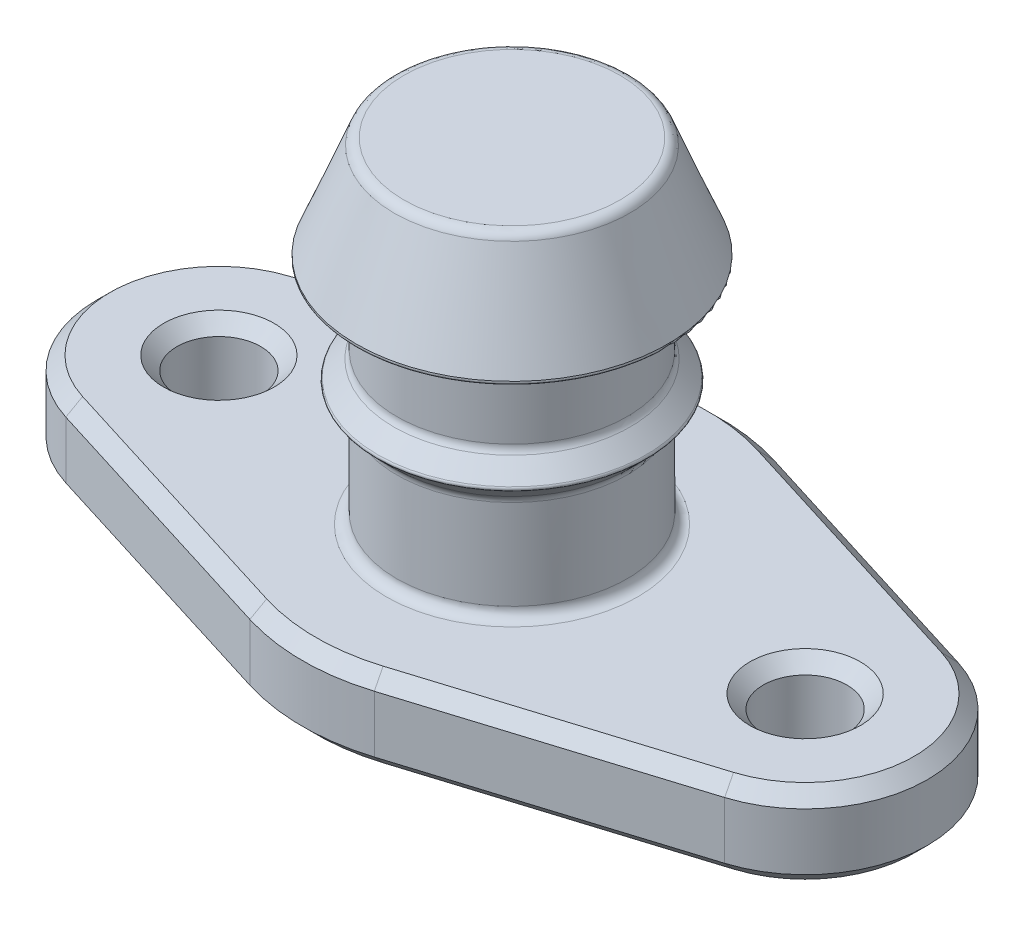
ISO-10303-21;
HEADER;
FILE_DESCRIPTION(('STEP AP214'),'2;1');
FILE_NAME('part.step','',(''),(''),'','','');
FILE_SCHEMA(('AUTOMOTIVE_DESIGN { 1 0 10303 214 1 1 1 1 }'));
ENDSEC;
DATA;
#1=APPLICATION_CONTEXT('core data for automotive mechanical design processes');
#2=APPLICATION_PROTOCOL_DEFINITION('international standard','automotive_design',2000,#1);
#3=PRODUCT_CONTEXT('',#1,'mechanical');
#4=PRODUCT('Part','Part','',(#3));
#5=PRODUCT_RELATED_PRODUCT_CATEGORY('part','',(#4));
#6=PRODUCT_DEFINITION_FORMATION('','',#4);
#7=PRODUCT_DEFINITION_CONTEXT('part definition',#1,'design');
#8=PRODUCT_DEFINITION('design','',#6,#7);
#9=PRODUCT_DEFINITION_SHAPE('','',#8);
#10=(LENGTH_UNIT() NAMED_UNIT(*) SI_UNIT(.MILLI.,.METRE.));
#11=(NAMED_UNIT(*) PLANE_ANGLE_UNIT() SI_UNIT($,.RADIAN.));
#12=(NAMED_UNIT(*) SI_UNIT($,.STERADIAN.) SOLID_ANGLE_UNIT());
#13=UNCERTAINTY_MEASURE_WITH_UNIT(LENGTH_MEASURE(1.E-05),#10,'distance_accuracy_value','');
#14=(GEOMETRIC_REPRESENTATION_CONTEXT(3) GLOBAL_UNCERTAINTY_ASSIGNED_CONTEXT((#13)) GLOBAL_UNIT_ASSIGNED_CONTEXT((#10,
#11,#12)) REPRESENTATION_CONTEXT('',''));
#15=CARTESIAN_POINT('',(0.,0.,0.));
#16=DIRECTION('',(0.,0.,1.));
#17=DIRECTION('',(1.,0.,0.));
#18=AXIS2_PLACEMENT_3D('',#15,#16,#17);
#19=CARTESIAN_POINT('',(0.,0.,0.));
#20=DIRECTION('',(0.,-1.,0.));
#21=DIRECTION('',(0.,0.,-1.));
#22=AXIS2_PLACEMENT_3D('',#19,#20,#21);
#23=CYLINDRICAL_SURFACE('',#22,7.9375);
#24=DIRECTION('',(0.,-1.,0.));
#25=VECTOR('',#24,1.);
#26=CARTESIAN_POINT('',(2.35857142857143,23.3997616978469,-7.57898720584265));
#27=LINE('',#26,#25);
#28=CARTESIAN_POINT('',(2.35857142857143,2.66700000000002,-7.57898720584265));
#29=VERTEX_POINT('',#28);
#30=CARTESIAN_POINT('',(2.35857142857143,0.508000000000012,-7.57898720584265));
#31=VERTEX_POINT('',#30);
#32=EDGE_CURVE('E328',#29,#31,#27,.T.);
#33=ORIENTED_EDGE('',*,*,#32,.T.);
#34=CARTESIAN_POINT('',(0.,0.508000000000005,0.));
#35=DIRECTION('',(0.,-1.,0.));
#36=DIRECTION('',(0.,0.,-1.));
#37=AXIS2_PLACEMENT_3D('',#34,#35,#36);
#38=CIRCLE('',#37,7.9375);
#39=CARTESIAN_POINT('',(-2.35857142857143,0.508000000000012,-7.57898720584265));
#40=VERTEX_POINT('',#39);
#41=EDGE_CURVE('E207',#31,#40,#38,.F.);
#42=ORIENTED_EDGE('',*,*,#41,.T.);
#43=DIRECTION('',(0.,-1.,0.));
#44=VECTOR('',#43,1.);
#45=CARTESIAN_POINT('',(-2.35857142857143,23.3997616978469,-7.57898720584265));
#46=LINE('',#45,#44);
#47=CARTESIAN_POINT('',(-2.35857142857143,2.66700000000002,-7.57898720584265));
#48=VERTEX_POINT('',#47);
#49=EDGE_CURVE('E317',#48,#40,#46,.T.);
#50=ORIENTED_EDGE('',*,*,#49,.F.);
#51=CARTESIAN_POINT('',(0.,2.66700000000001,0.));
#52=DIRECTION('',(0.,1.,0.));
#53=DIRECTION('',(0.,0.,1.));
#54=AXIS2_PLACEMENT_3D('',#51,#52,#53);
#55=CIRCLE('',#54,7.9375);
#56=EDGE_CURVE('E205',#48,#29,#55,.F.);
#57=ORIENTED_EDGE('',*,*,#56,.T.);
#58=EDGE_LOOP('',(#33,#42,#50,#57));
#59=FACE_BOUND('',#58,.T.);
#60=ADVANCED_FACE('F35',(#59),#23,.T.);
#61=DIRECTION('',(0.,-1.,0.));
#62=VECTOR('',#61,1.);
#63=CARTESIAN_POINT('',(-2.35857142857143,23.3997616978469,7.57898720584265));
#64=LINE('',#63,#62);
#65=CARTESIAN_POINT('',(-2.35857142857143,2.66700000000002,7.57898720584265));
#66=VERTEX_POINT('',#65);
#67=CARTESIAN_POINT('',(-2.35857142857143,0.508000000000012,7.57898720584265));
#68=VERTEX_POINT('',#67);
#69=EDGE_CURVE('E259',#66,#68,#64,.T.);
#70=ORIENTED_EDGE('',*,*,#69,.T.);
#71=CARTESIAN_POINT('',(0.,0.508000000000005,0.));
#72=DIRECTION('',(0.,-1.,0.));
#73=DIRECTION('',(0.,0.,-1.));
#74=AXIS2_PLACEMENT_3D('',#71,#72,#73);
#75=CIRCLE('',#74,7.9375);
#76=CARTESIAN_POINT('',(2.35857142857143,0.508000000000012,7.57898720584265));
#77=VERTEX_POINT('',#76);
#78=EDGE_CURVE('E224',#68,#77,#75,.F.);
#79=ORIENTED_EDGE('',*,*,#78,.T.);
#80=DIRECTION('',(0.,-1.,0.));
#81=VECTOR('',#80,1.);
#82=CARTESIAN_POINT('',(2.35857142857143,23.3997616978469,7.57898720584265));
#83=LINE('',#82,#81);
#84=CARTESIAN_POINT('',(2.35857142857143,2.66700000000002,7.57898720584265));
#85=VERTEX_POINT('',#84);
#86=EDGE_CURVE('E311',#85,#77,#83,.T.);
#87=ORIENTED_EDGE('',*,*,#86,.F.);
#88=CARTESIAN_POINT('',(0.,2.66700000000001,0.));
#89=DIRECTION('',(0.,1.,0.));
#90=DIRECTION('',(0.,0.,1.));
#91=AXIS2_PLACEMENT_3D('',#88,#89,#90);
#92=CIRCLE('',#91,7.9375);
#93=EDGE_CURVE('E222',#85,#66,#92,.F.);
#94=ORIENTED_EDGE('',*,*,#93,.T.);
#95=EDGE_LOOP('',(#70,#79,#87,#94));
#96=FACE_BOUND('',#95,.T.);
#97=ADVANCED_FACE('F309',(#96),#23,.T.);
#98=CARTESIAN_POINT('',(0.,0.,0.));
#99=DIRECTION('',(0.,-1.,0.));
#100=DIRECTION('',(0.,0.,-1.));
#101=AXIS2_PLACEMENT_3D('',#98,#99,#100);
#102=PLANE('',#101);
#103=CARTESIAN_POINT('',(-11.1125,0.,0.));
#104=DIRECTION('',(0.,-1.,0.));
#105=DIRECTION('',(0.,0.,-1.));
#106=AXIS2_PLACEMENT_3D('',#103,#104,#105);
#107=CIRCLE('',#106,2.09550000000002);
#108=CARTESIAN_POINT('',(-11.1125,0.,-2.09550000000002));
#109=VERTEX_POINT('',#108);
#110=EDGE_CURVE('E180',#109,#109,#107,.F.);
#111=ORIENTED_EDGE('',*,*,#110,.T.);
#112=EDGE_LOOP('',(#111));
#113=FACE_BOUND('',#112,.T.);
#114=CARTESIAN_POINT('',(11.1125,0.,0.));
#115=DIRECTION('',(0.,-1.,0.));
#116=DIRECTION('',(0.,0.,-1.));
#117=AXIS2_PLACEMENT_3D('',#114,#115,#116);
#118=CIRCLE('',#117,2.09550000000002);
#119=CARTESIAN_POINT('',(11.1125,0.,-2.09550000000002));
#120=VERTEX_POINT('',#119);
#121=EDGE_CURVE('E177',#120,#120,#118,.F.);
#122=ORIENTED_EDGE('',*,*,#121,.T.);
#123=EDGE_LOOP('',(#122));
#124=FACE_BOUND('',#123,.T.);
#125=CARTESIAN_POINT('',(11.1125,0.,0.));
#126=DIRECTION('',(0.,-1.,0.));
#127=DIRECTION('',(0.,0.,-1.));
#128=AXIS2_PLACEMENT_3D('',#125,#126,#127);
#129=CIRCLE('',#128,4.1275);
#130=CARTESIAN_POINT('',(12.3389571428571,0.,-3.94107334703817));
#131=VERTEX_POINT('',#130);
#132=CARTESIAN_POINT('',(12.3389571428571,0.,3.94107334703817));
#133=VERTEX_POINT('',#132);
#134=EDGE_CURVE('E175',#131,#133,#129,.T.);
#135=ORIENTED_EDGE('',*,*,#134,.T.);
#136=DIRECTION('',(-0.954833033806948,0.,0.297142857142857));
#137=VECTOR('',#136,1.);
#138=CARTESIAN_POINT('',(2.20762285714286,0.,7.09393202466871));
#139=LINE('',#138,#137);
#140=CARTESIAN_POINT('',(2.20762285714286,0.,7.09393202466871));
#141=VERTEX_POINT('',#140);
#142=EDGE_CURVE('E156',#133,#141,#139,.T.);
#143=ORIENTED_EDGE('',*,*,#142,.T.);
#144=CARTESIAN_POINT('',(0.,0.,0.));
#145=DIRECTION('',(0.,-1.,0.));
#146=DIRECTION('',(0.,0.,-1.));
#147=AXIS2_PLACEMENT_3D('',#144,#145,#146);
#148=CIRCLE('',#147,7.4295);
#149=CARTESIAN_POINT('',(-2.20762285714285,0.,7.09393202466871));
#150=VERTEX_POINT('',#149);
#151=EDGE_CURVE('E164',#141,#150,#148,.T.);
#152=ORIENTED_EDGE('',*,*,#151,.T.);
#153=DIRECTION('',(-0.954833033806948,0.,-0.297142857142857));
#154=VECTOR('',#153,1.);
#155=CARTESIAN_POINT('',(-2.20762285714285,0.,7.09393202466871));
#156=LINE('',#155,#154);
#157=CARTESIAN_POINT('',(-12.3389571428571,0.,3.94107334703817));
#158=VERTEX_POINT('',#157);
#159=EDGE_CURVE('E170',#150,#158,#156,.T.);
#160=ORIENTED_EDGE('',*,*,#159,.T.);
#161=CARTESIAN_POINT('',(-11.1125,0.,0.));
#162=DIRECTION('',(0.,-1.,0.));
#163=DIRECTION('',(0.,0.,-1.));
#164=AXIS2_PLACEMENT_3D('',#161,#162,#163);
#165=CIRCLE('',#164,4.1275);
#166=CARTESIAN_POINT('',(-12.3389571428571,0.,-3.94107334703817));
#167=VERTEX_POINT('',#166);
#168=EDGE_CURVE('E384',#158,#167,#165,.T.);
#169=ORIENTED_EDGE('',*,*,#168,.T.);
#170=DIRECTION('',(0.954833033806948,0.,-0.297142857142857));
#171=VECTOR('',#170,1.);
#172=CARTESIAN_POINT('',(-2.20762285714286,0.,-7.09393202466871));
#173=LINE('',#172,#171);
#174=CARTESIAN_POINT('',(-2.20762285714286,0.,-7.09393202466871));
#175=VERTEX_POINT('',#174);
#176=EDGE_CURVE('E386',#167,#175,#173,.T.);
#177=ORIENTED_EDGE('',*,*,#176,.T.);
#178=CARTESIAN_POINT('',(0.,0.,0.));
#179=DIRECTION('',(0.,-1.,0.));
#180=DIRECTION('',(0.,0.,-1.));
#181=AXIS2_PLACEMENT_3D('',#178,#179,#180);
#182=CIRCLE('',#181,7.42949999999999);
#183=CARTESIAN_POINT('',(2.20762285714286,0.,-7.09393202466871));
#184=VERTEX_POINT('',#183);
#185=EDGE_CURVE('E388',#175,#184,#182,.T.);
#186=ORIENTED_EDGE('',*,*,#185,.T.);
#187=DIRECTION('',(0.954833033806948,0.,0.297142857142857));
#188=VECTOR('',#187,1.);
#189=CARTESIAN_POINT('',(2.20762285714286,0.,-7.09393202466871));
#190=LINE('',#189,#188);
#191=EDGE_CURVE('E182',#184,#131,#190,.T.);
#192=ORIENTED_EDGE('',*,*,#191,.T.);
#193=EDGE_LOOP('',(#135,#143,#152,#160,#169,#177,#186,#192));
#194=FACE_BOUND('',#193,.T.);
#195=ADVANCED_FACE('F173',(#113,#124,#194),#102,.T.);
#196=CARTESIAN_POINT('',(7.9375,3.175,0.));
#197=DIRECTION('',(0.,1.,0.));
#198=DIRECTION('',(0.,0.,1.));
#199=AXIS2_PLACEMENT_3D('',#196,#197,#198);
#200=PLANE('',#199);
#201=CARTESIAN_POINT('',(-11.1125,3.175,0.));
#202=DIRECTION('',(0.,1.,0.));
#203=DIRECTION('',(0.,0.,1.));
#204=AXIS2_PLACEMENT_3D('',#201,#202,#203);
#205=CIRCLE('',#204,2.09549999999998);
#206=CARTESIAN_POINT('',(-11.1125,3.175,2.09549999999998));
#207=VERTEX_POINT('',#206);
#208=EDGE_CURVE('E11',#207,#207,#205,.F.);
#209=ORIENTED_EDGE('',*,*,#208,.T.);
#210=EDGE_LOOP('',(#209));
#211=FACE_BOUND('',#210,.T.);
#212=CARTESIAN_POINT('',(11.1125,3.175,0.));
#213=DIRECTION('',(0.,1.,0.));
#214=DIRECTION('',(0.,0.,1.));
#215=AXIS2_PLACEMENT_3D('',#212,#213,#214);
#216=CIRCLE('',#215,2.09549999999997);
#217=CARTESIAN_POINT('',(11.1125,3.175,2.09549999999997));
#218=VERTEX_POINT('',#217);
#219=EDGE_CURVE('E45',#218,#218,#216,.F.);
#220=ORIENTED_EDGE('',*,*,#219,.T.);
#221=EDGE_LOOP('',(#220));
#222=FACE_BOUND('',#221,.T.);
#223=CARTESIAN_POINT('',(-11.1125,3.175,0.));
#224=DIRECTION('',(0.,1.,0.));
#225=DIRECTION('',(0.,0.,1.));
#226=AXIS2_PLACEMENT_3D('',#223,#224,#225);
#227=CIRCLE('',#226,4.1275);
#228=CARTESIAN_POINT('',(-12.3389571428571,3.175,-3.94107334703818));
#229=VERTEX_POINT('',#228);
#230=CARTESIAN_POINT('',(-12.3389571428571,3.175,3.94107334703818));
#231=VERTEX_POINT('',#230);
#232=EDGE_CURVE('E53',#229,#231,#227,.T.);
#233=ORIENTED_EDGE('',*,*,#232,.T.);
#234=DIRECTION('',(0.954833033806948,0.,0.297142857142857));
#235=VECTOR('',#234,1.);
#236=CARTESIAN_POINT('',(5.02904448979592,3.175,9.34597393726196));
#237=LINE('',#236,#235);
#238=CARTESIAN_POINT('',(-2.20762285714286,3.175,7.09393202466872));
#239=VERTEX_POINT('',#238);
#240=EDGE_CURVE('E238',#231,#239,#237,.T.);
#241=ORIENTED_EDGE('',*,*,#240,.T.);
#242=CARTESIAN_POINT('',(0.,3.175,0.));
#243=DIRECTION('',(0.,1.,0.));
#244=DIRECTION('',(0.,0.,1.));
#245=AXIS2_PLACEMENT_3D('',#242,#243,#244);
#246=CIRCLE('',#245,7.42950000000001);
#247=CARTESIAN_POINT('',(2.20762285714286,3.175,7.09393202466872));
#248=VERTEX_POINT('',#247);
#249=EDGE_CURVE('E226',#239,#248,#246,.T.);
#250=ORIENTED_EDGE('',*,*,#249,.T.);
#251=DIRECTION('',(0.954833033806948,0.,-0.297142857142857));
#252=VECTOR('',#251,1.);
#253=CARTESIAN_POINT('',(9.44429020408163,3.175,4.84189011207548));
#254=LINE('',#253,#252);
#255=CARTESIAN_POINT('',(12.3389571428571,3.175,3.94107334703818));
#256=VERTEX_POINT('',#255);
#257=EDGE_CURVE('E228',#248,#256,#254,.T.);
#258=ORIENTED_EDGE('',*,*,#257,.T.);
#259=CARTESIAN_POINT('',(11.1125,3.175,0.));
#260=DIRECTION('',(0.,1.,0.));
#261=DIRECTION('',(0.,0.,1.));
#262=AXIS2_PLACEMENT_3D('',#259,#260,#261);
#263=CIRCLE('',#262,4.1275);
#264=CARTESIAN_POINT('',(12.3389571428571,3.175,-3.94107334703818));
#265=VERTEX_POINT('',#264);
#266=EDGE_CURVE('E230',#256,#265,#263,.T.);
#267=ORIENTED_EDGE('',*,*,#266,.T.);
#268=DIRECTION('',(-0.954833033806948,0.,-0.297142857142857));
#269=VECTOR('',#268,1.);
#270=CARTESIAN_POINT('',(9.44429020408163,3.175,-4.84189011207548));
#271=LINE('',#270,#269);
#272=CARTESIAN_POINT('',(2.20762285714286,3.175,-7.09393202466872));
#273=VERTEX_POINT('',#272);
#274=EDGE_CURVE('E232',#265,#273,#271,.T.);
#275=ORIENTED_EDGE('',*,*,#274,.T.);
#276=CARTESIAN_POINT('',(0.,3.175,0.));
#277=DIRECTION('',(0.,1.,0.));
#278=DIRECTION('',(0.,0.,1.));
#279=AXIS2_PLACEMENT_3D('',#276,#277,#278);
#280=CIRCLE('',#279,7.42950000000001);
#281=CARTESIAN_POINT('',(-2.20762285714286,3.175,-7.09393202466872));
#282=VERTEX_POINT('',#281);
#283=EDGE_CURVE('E234',#273,#282,#280,.T.);
#284=ORIENTED_EDGE('',*,*,#283,.T.);
#285=DIRECTION('',(-0.954833033806948,0.,0.297142857142857));
#286=VECTOR('',#285,1.);
#287=CARTESIAN_POINT('',(5.02904448979592,3.175,-9.34597393726197));
#288=LINE('',#287,#286);
#289=EDGE_CURVE('E58',#282,#229,#288,.T.);
#290=ORIENTED_EDGE('',*,*,#289,.T.);
#291=EDGE_LOOP('',(#233,#241,#250,#258,#267,#275,#284,#290));
#292=FACE_BOUND('',#291,.T.);
#293=CARTESIAN_POINT('',(0.,3.175,0.));
#294=DIRECTION('',(0.,1.,0.));
#295=DIRECTION('',(0.,0.,1.));
#296=AXIS2_PLACEMENT_3D('',#293,#294,#295);
#297=CIRCLE('',#296,4.7625);
#298=CARTESIAN_POINT('',(0.,3.175,4.7625));
#299=VERTEX_POINT('',#298);
#300=EDGE_CURVE('E363',#299,#299,#297,.F.);
#301=ORIENTED_EDGE('',*,*,#300,.T.);
#302=EDGE_LOOP('',(#301));
#303=FACE_BOUND('',#302,.T.);
#304=ADVANCED_FACE('F291',(#211,#222,#292,#303),#200,.T.);
#305=CARTESIAN_POINT('',(0.,0.,0.));
#306=DIRECTION('',(0.,-1.,0.));
#307=DIRECTION('',(0.,0.,-1.));
#308=AXIS2_PLACEMENT_3D('',#305,#306,#307);
#309=CYLINDRICAL_SURFACE('',#308,4.365625);
#310=CARTESIAN_POINT('',(0.,6.97935899243318,0.));
#311=DIRECTION('',(0.,-1.,0.));
#312=DIRECTION('',(0.,0.,-1.));
#313=AXIS2_PLACEMENT_3D('',#310,#311,#312);
#314=CIRCLE('',#313,4.365625);
#315=CARTESIAN_POINT('',(0.,6.97935899243318,-4.365625));
#316=VERTEX_POINT('',#315);
#317=EDGE_CURVE('E354',#316,#316,#314,.T.);
#318=ORIENTED_EDGE('',*,*,#317,.T.);
#319=EDGE_LOOP('',(#318));
#320=FACE_BOUND('',#319,.T.);
#321=CARTESIAN_POINT('',(0.,3.571875,0.));
#322=DIRECTION('',(0.,1.,0.));
#323=DIRECTION('',(0.,0.,1.));
#324=AXIS2_PLACEMENT_3D('',#321,#322,#323);
#325=CIRCLE('',#324,4.365625);
#326=CARTESIAN_POINT('',(0.,3.571875,4.365625));
#327=VERTEX_POINT('',#326);
#328=EDGE_CURVE('E351',#327,#327,#325,.T.);
#329=ORIENTED_EDGE('',*,*,#328,.T.);
#330=EDGE_LOOP('',(#329));
#331=FACE_BOUND('',#330,.T.);
#332=ADVANCED_FACE('F729',(#320,#331),#309,.T.);
#333=CARTESIAN_POINT('',(0.,7.14375,0.));
#334=DIRECTION('',(0.,1.,0.));
#335=DIRECTION('',(0.,0.,1.));
#336=AXIS2_PLACEMENT_3D('',#333,#334,#335);
#337=CONICAL_SURFACE('',#336,4.365625,0.785398163397448);
#338=CARTESIAN_POINT('',(0.,7.86734174905415,0.));
#339=DIRECTION('',(0.,-1.,0.));
#340=DIRECTION('',(0.,0.,-1.));
#341=AXIS2_PLACEMENT_3D('',#338,#339,#340);
#342=CIRCLE('',#341,5.08921674905415);
#343=CARTESIAN_POINT('',(0.,7.86734174905415,-5.08921674905415));
#344=VERTEX_POINT('',#343);
#345=EDGE_CURVE('E366',#344,#344,#342,.T.);
#346=ORIENTED_EDGE('',*,*,#345,.T.);
#347=EDGE_LOOP('',(#346));
#348=FACE_BOUND('',#347,.T.);
#349=CARTESIAN_POINT('',(0.,7.25999199621659,0.));
#350=DIRECTION('',(0.,1.,0.));
#351=DIRECTION('',(0.,0.,1.));
#352=AXIS2_PLACEMENT_3D('',#349,#350,#351);
#353=CIRCLE('',#352,4.48186699621659);
#354=CARTESIAN_POINT('',(0.,7.25999199621659,4.48186699621659));
#355=VERTEX_POINT('',#354);
#356=EDGE_CURVE('E357',#355,#355,#353,.T.);
#357=ORIENTED_EDGE('',*,*,#356,.T.);
#358=EDGE_LOOP('',(#357));
#359=FACE_BOUND('',#358,.T.);
#360=ADVANCED_FACE('F772',(#348,#359),#337,.T.);
#361=CARTESIAN_POINT('',(0.,7.9375,0.));
#362=DIRECTION('',(0.,-1.,0.));
#363=DIRECTION('',(0.,0.,-1.));
#364=AXIS2_PLACEMENT_3D('',#361,#362,#363);
#365=CONICAL_SURFACE('',#364,5.159375,0.785398163397448);
#366=CARTESIAN_POINT('',(0.,8.00765825094585,0.));
#367=DIRECTION('',(0.,1.,0.));
#368=DIRECTION('',(0.,0.,1.));
#369=AXIS2_PLACEMENT_3D('',#366,#367,#368);
#370=CIRCLE('',#369,5.08921674905415);
#371=CARTESIAN_POINT('',(0.,8.00765825094585,5.08921674905415));
#372=VERTEX_POINT('',#371);
#373=EDGE_CURVE('E369',#372,#372,#370,.T.);
#374=ORIENTED_EDGE('',*,*,#373,.T.);
#375=EDGE_LOOP('',(#374));
#376=FACE_BOUND('',#375,.T.);
#377=CARTESIAN_POINT('',(0.,8.61500800378341,0.));
#378=DIRECTION('',(0.,-1.,0.));
#379=DIRECTION('',(0.,0.,-1.));
#380=AXIS2_PLACEMENT_3D('',#377,#378,#379);
#381=CIRCLE('',#380,4.48186699621659);
#382=CARTESIAN_POINT('',(0.,8.61500800378341,-4.48186699621659));
#383=VERTEX_POINT('',#382);
#384=EDGE_CURVE('E360',#383,#383,#381,.T.);
#385=ORIENTED_EDGE('',*,*,#384,.T.);
#386=EDGE_LOOP('',(#385));
#387=FACE_BOUND('',#386,.T.);
#388=ADVANCED_FACE('F780',(#376,#387),#365,.T.);
#389=CARTESIAN_POINT('',(0.,0.,0.));
#390=DIRECTION('',(0.,-1.,0.));
#391=DIRECTION('',(0.,0.,-1.));
#392=AXIS2_PLACEMENT_3D('',#389,#390,#391);
#393=CYLINDRICAL_SURFACE('',#392,4.365625);
#394=CARTESIAN_POINT('',(0.,11.509375,0.));
#395=DIRECTION('',(0.,-1.,0.));
#396=DIRECTION('',(0.,0.,-1.));
#397=AXIS2_PLACEMENT_3D('',#394,#395,#396);
#398=CIRCLE('',#397,4.365625);
#399=CARTESIAN_POINT('',(0.,11.509375,-4.365625));
#400=VERTEX_POINT('',#399);
#401=EDGE_CURVE('E345',#400,#400,#398,.T.);
#402=ORIENTED_EDGE('',*,*,#401,.T.);
#403=EDGE_LOOP('',(#402));
#404=FACE_BOUND('',#403,.T.);
#405=CARTESIAN_POINT('',(0.,8.89564100756682,0.));
#406=DIRECTION('',(0.,-1.,0.));
#407=DIRECTION('',(0.,0.,-1.));
#408=AXIS2_PLACEMENT_3D('',#405,#406,#407);
#409=CIRCLE('',#408,4.365625);
#410=CARTESIAN_POINT('',(0.,8.89564100756682,-4.365625));
#411=VERTEX_POINT('',#410);
#412=EDGE_CURVE('E342',#411,#411,#409,.F.);
#413=ORIENTED_EDGE('',*,*,#412,.T.);
#414=EDGE_LOOP('',(#413));
#415=FACE_BOUND('',#414,.T.);
#416=ADVANCED_FACE('F789',(#404,#415),#393,.T.);
#417=CARTESIAN_POINT('',(4.365625,11.90625,0.));
#418=DIRECTION('',(0.,-1.,0.));
#419=DIRECTION('',(0.,0.,-1.));
#420=AXIS2_PLACEMENT_3D('',#417,#418,#419);
#421=PLANE('',#420);
#422=CARTESIAN_POINT('',(0.,11.90625,0.));
#423=DIRECTION('',(0.,-1.,0.));
#424=DIRECTION('',(0.,0.,-1.));
#425=AXIS2_PLACEMENT_3D('',#422,#423,#424);
#426=CIRCLE('',#425,5.80657563585843);
#427=CARTESIAN_POINT('',(0.,11.90625,-5.80657563585843));
#428=VERTEX_POINT('',#427);
#429=EDGE_CURVE('E372',#428,#428,#426,.T.);
#430=ORIENTED_EDGE('',*,*,#429,.T.);
#431=EDGE_LOOP('',(#430));
#432=FACE_BOUND('',#431,.T.);
#433=CARTESIAN_POINT('',(0.,11.90625,0.));
#434=DIRECTION('',(0.,-1.,0.));
#435=DIRECTION('',(0.,0.,-1.));
#436=AXIS2_PLACEMENT_3D('',#433,#434,#435);
#437=CIRCLE('',#436,4.7625);
#438=CARTESIAN_POINT('',(0.,11.90625,-4.7625));
#439=VERTEX_POINT('',#438);
#440=EDGE_CURVE('E348',#439,#439,#437,.F.);
#441=ORIENTED_EDGE('',*,*,#440,.T.);
#442=EDGE_LOOP('',(#441));
#443=FACE_BOUND('',#442,.T.);
#444=ADVANCED_FACE('F798',(#432,#443),#421,.T.);
#445=CARTESIAN_POINT('',(0.,11.90625,0.));
#446=DIRECTION('',(0.,-1.,0.));
#447=DIRECTION('',(0.,0.,-1.));
#448=AXIS2_PLACEMENT_3D('',#445,#446,#447);
#449=CONICAL_SURFACE('',#448,5.953125,0.380506377112366);
#450=CARTESIAN_POINT('',(0.,12.0423176686695,0.));
#451=DIRECTION('',(0.,1.,0.));
#452=DIRECTION('',(0.,0.,1.));
#453=AXIS2_PLACEMENT_3D('',#450,#451,#452);
#454=CIRCLE('',#453,5.8986979325322);
#455=CARTESIAN_POINT('',(0.,12.0423176686695,5.8986979325322));
#456=VERTEX_POINT('',#455);
#457=EDGE_CURVE('E375',#456,#456,#454,.T.);
#458=ORIENTED_EDGE('',*,*,#457,.T.);
#459=EDGE_LOOP('',(#458));
#460=FACE_BOUND('',#459,.T.);
#461=CARTESIAN_POINT('',(0.,15.625520674678,0.));
#462=DIRECTION('',(0.,1.,0.));
#463=DIRECTION('',(0.,0.,1.));
#464=AXIS2_PLACEMENT_3D('',#461,#462,#463);
#465=CIRCLE('',#464,4.46541673012879);
#466=CARTESIAN_POINT('',(0.,15.625520674678,4.46541673012879));
#467=VERTEX_POINT('',#466);
#468=EDGE_CURVE('E334',#467,#467,#465,.F.);
#469=ORIENTED_EDGE('',*,*,#468,.T.);
#470=EDGE_LOOP('',(#469));
#471=FACE_BOUND('',#470,.T.);
#472=ADVANCED_FACE('F806',(#460,#471),#449,.T.);
#473=CARTESIAN_POINT('',(4.365625,15.875,0.));
#474=DIRECTION('',(0.,1.,0.));
#475=DIRECTION('',(0.,0.,1.));
#476=AXIS2_PLACEMENT_3D('',#473,#474,#475);
#477=PLANE('',#476);
#478=CARTESIAN_POINT('',(0.,15.875,0.));
#479=DIRECTION('',(0.,1.,0.));
#480=DIRECTION('',(0.,0.,1.));
#481=AXIS2_PLACEMENT_3D('',#478,#479,#480);
#482=CIRCLE('',#481,4.0969275434337);
#483=CARTESIAN_POINT('',(0.,15.875,4.0969275434337));
#484=VERTEX_POINT('',#483);
#485=EDGE_CURVE('E339',#484,#484,#482,.T.);
#486=ORIENTED_EDGE('',*,*,#485,.T.);
#487=EDGE_LOOP('',(#486));
#488=FACE_BOUND('',#487,.T.);
#489=ADVANCED_FACE('F720',(#488),#477,.T.);
#490=CARTESIAN_POINT('',(12.4899057142857,23.3997616978469,4.42612852821211));
#491=DIRECTION('',(0.297142857142857,0.,0.954833033806948));
#492=DIRECTION('',(0.954833033806948,0.,-0.297142857142857));
#493=AXIS2_PLACEMENT_3D('',#490,#491,#492);
#494=PLANE('',#493);
#495=ORIENTED_EDGE('',*,*,#86,.T.);
#496=DIRECTION('',(0.954833033806948,0.,-0.297142857142857));
#497=VECTOR('',#496,1.);
#498=CARTESIAN_POINT('',(12.4899057142857,0.508000000000005,4.42612852821211));
#499=LINE('',#498,#497);
#500=CARTESIAN_POINT('',(12.4899057142857,0.508000000000012,4.42612852821211));
#501=VERTEX_POINT('',#500);
#502=EDGE_CURVE('E158',#77,#501,#499,.T.);
#503=ORIENTED_EDGE('',*,*,#502,.T.);
#504=DIRECTION('',(0.,-1.,0.));
#505=VECTOR('',#504,1.);
#506=CARTESIAN_POINT('',(12.4899057142857,23.3997616978469,4.42612852821211));
#507=LINE('',#506,#505);
#508=CARTESIAN_POINT('',(12.4899057142857,2.66700000000002,4.42612852821211));
#509=VERTEX_POINT('',#508);
#510=EDGE_CURVE('E327',#509,#501,#507,.T.);
#511=ORIENTED_EDGE('',*,*,#510,.F.);
#512=DIRECTION('',(-0.954833033806948,0.,0.297142857142857));
#513=VECTOR('',#512,1.);
#514=CARTESIAN_POINT('',(12.4899057142857,2.66700000000001,4.42612852821211));
#515=LINE('',#514,#513);
#516=EDGE_CURVE('E194',#509,#85,#515,.T.);
#517=ORIENTED_EDGE('',*,*,#516,.T.);
#518=EDGE_LOOP('',(#495,#503,#511,#517));
#519=FACE_BOUND('',#518,.T.);
#520=ADVANCED_FACE('F403',(#519),#494,.T.);
#521=CARTESIAN_POINT('',(11.1125,23.3997616978469,0.));
#522=DIRECTION('',(0.,-1.,0.));
#523=DIRECTION('',(0.,0.,-1.));
#524=AXIS2_PLACEMENT_3D('',#521,#522,#523);
#525=CYLINDRICAL_SURFACE('',#524,4.6355);
#526=ORIENTED_EDGE('',*,*,#510,.T.);
#527=CARTESIAN_POINT('',(11.1125,0.508000000000005,0.));
#528=DIRECTION('',(0.,-1.,0.));
#529=DIRECTION('',(0.,0.,-1.));
#530=AXIS2_PLACEMENT_3D('',#527,#528,#529);
#531=CIRCLE('',#530,4.6355);
#532=CARTESIAN_POINT('',(12.4899057142857,0.508000000000012,-4.42612852821211));
#533=VERTEX_POINT('',#532);
#534=EDGE_CURVE('E199',#501,#533,#531,.F.);
#535=ORIENTED_EDGE('',*,*,#534,.T.);
#536=DIRECTION('',(0.,-1.,0.));
#537=VECTOR('',#536,1.);
#538=CARTESIAN_POINT('',(12.4899057142857,23.3997616978469,-4.42612852821211));
#539=LINE('',#538,#537);
#540=CARTESIAN_POINT('',(12.4899057142857,2.66700000000001,-4.42612852821211));
#541=VERTEX_POINT('',#540);
#542=EDGE_CURVE('E331',#541,#533,#539,.T.);
#543=ORIENTED_EDGE('',*,*,#542,.F.);
#544=CARTESIAN_POINT('',(11.1125,2.66700000000001,0.));
#545=DIRECTION('',(0.,1.,0.));
#546=DIRECTION('',(0.,0.,1.));
#547=AXIS2_PLACEMENT_3D('',#544,#545,#546);
#548=CIRCLE('',#547,4.6355);
#549=EDGE_CURVE('E197',#541,#509,#548,.F.);
#550=ORIENTED_EDGE('',*,*,#549,.T.);
#551=EDGE_LOOP('',(#526,#535,#543,#550));
#552=FACE_BOUND('',#551,.T.);
#553=ADVANCED_FACE('F404',(#552),#525,.T.);
#554=CARTESIAN_POINT('',(2.35857142857143,23.3997616978469,-7.57898720584265));
#555=DIRECTION('',(0.297142857142857,0.,-0.954833033806948));
#556=DIRECTION('',(-0.954833033806948,0.,-0.297142857142857));
#557=AXIS2_PLACEMENT_3D('',#554,#555,#556);
#558=PLANE('',#557);
#559=ORIENTED_EDGE('',*,*,#542,.T.);
#560=DIRECTION('',(-0.954833033806948,0.,-0.297142857142857));
#561=VECTOR('',#560,1.);
#562=CARTESIAN_POINT('',(2.35857142857143,0.508000000000005,-7.57898720584265));
#563=LINE('',#562,#561);
#564=EDGE_CURVE('E203',#533,#31,#563,.T.);
#565=ORIENTED_EDGE('',*,*,#564,.T.);
#566=ORIENTED_EDGE('',*,*,#32,.F.);
#567=DIRECTION('',(0.954833033806948,0.,0.297142857142857));
#568=VECTOR('',#567,1.);
#569=CARTESIAN_POINT('',(2.35857142857143,2.66700000000001,-7.57898720584265));
#570=LINE('',#569,#568);
#571=EDGE_CURVE('E201',#29,#541,#570,.T.);
#572=ORIENTED_EDGE('',*,*,#571,.T.);
#573=EDGE_LOOP('',(#559,#565,#566,#572));
#574=FACE_BOUND('',#573,.T.);
#575=ADVANCED_FACE('F406',(#574),#558,.T.);
#576=CARTESIAN_POINT('',(11.1125,23.3997616978469,0.));
#577=DIRECTION('',(0.,-1.,0.));
#578=DIRECTION('',(0.,0.,-1.));
#579=AXIS2_PLACEMENT_3D('',#576,#577,#578);
#580=CYLINDRICAL_SURFACE('',#579,1.5875);
#581=CARTESIAN_POINT('',(11.1125,0.508000000000019,0.));
#582=DIRECTION('',(0.,-1.,0.));
#583=DIRECTION('',(0.,0.,-1.));
#584=AXIS2_PLACEMENT_3D('',#581,#582,#583);
#585=CIRCLE('',#584,1.5875);
#586=CARTESIAN_POINT('',(11.1125,0.508000000000019,-1.5875));
#587=VERTEX_POINT('',#586);
#588=EDGE_CURVE('E191',#587,#587,#585,.T.);
#589=ORIENTED_EDGE('',*,*,#588,.T.);
#590=EDGE_LOOP('',(#589));
#591=FACE_BOUND('',#590,.T.);
#592=CARTESIAN_POINT('',(11.1125,2.66700000000003,0.));
#593=DIRECTION('',(0.,1.,0.));
#594=DIRECTION('',(0.,0.,1.));
#595=AXIS2_PLACEMENT_3D('',#592,#593,#594);
#596=CIRCLE('',#595,1.5875);
#597=CARTESIAN_POINT('',(11.1125,2.66700000000003,1.5875));
#598=VERTEX_POINT('',#597);
#599=EDGE_CURVE('E188',#598,#598,#596,.T.);
#600=ORIENTED_EDGE('',*,*,#599,.T.);
#601=EDGE_LOOP('',(#600));
#602=FACE_BOUND('',#601,.T.);
#603=ADVANCED_FACE('F686',(#591,#602),#580,.F.);
#604=CARTESIAN_POINT('',(-12.4899057142857,23.3997616978469,-4.42612852821211));
#605=DIRECTION('',(-0.297142857142857,0.,-0.954833033806948));
#606=DIRECTION('',(-0.954833033806948,0.,0.297142857142857));
#607=AXIS2_PLACEMENT_3D('',#604,#605,#606);
#608=PLANE('',#607);
#609=ORIENTED_EDGE('',*,*,#49,.T.);
#610=DIRECTION('',(-0.954833033806948,0.,0.297142857142857));
#611=VECTOR('',#610,1.);
#612=CARTESIAN_POINT('',(-12.4899057142857,0.508000000000005,-4.42612852821211));
#613=LINE('',#612,#611);
#614=CARTESIAN_POINT('',(-12.4899057142857,0.508000000000012,-4.42612852821211));
#615=VERTEX_POINT('',#614);
#616=EDGE_CURVE('E211',#40,#615,#613,.T.);
#617=ORIENTED_EDGE('',*,*,#616,.T.);
#618=DIRECTION('',(0.,-1.,0.));
#619=VECTOR('',#618,1.);
#620=CARTESIAN_POINT('',(-12.4899057142857,23.3997616978469,-4.42612852821211));
#621=LINE('',#620,#619);
#622=CARTESIAN_POINT('',(-12.4899057142857,2.66700000000002,-4.42612852821211));
#623=VERTEX_POINT('',#622);
#624=EDGE_CURVE('E320',#623,#615,#621,.T.);
#625=ORIENTED_EDGE('',*,*,#624,.F.);
#626=DIRECTION('',(0.954833033806948,0.,-0.297142857142857));
#627=VECTOR('',#626,1.);
#628=CARTESIAN_POINT('',(-12.4899057142857,2.66700000000001,-4.42612852821211));
#629=LINE('',#628,#627);
#630=EDGE_CURVE('E209',#623,#48,#629,.T.);
#631=ORIENTED_EDGE('',*,*,#630,.T.);
#632=EDGE_LOOP('',(#609,#617,#625,#631));
#633=FACE_BOUND('',#632,.T.);
#634=ADVANCED_FACE('F423',(#633),#608,.T.);
#635=CARTESIAN_POINT('',(-11.1125,23.3997616978469,0.));
#636=DIRECTION('',(0.,-1.,0.));
#637=DIRECTION('',(0.,0.,-1.));
#638=AXIS2_PLACEMENT_3D('',#635,#636,#637);
#639=CYLINDRICAL_SURFACE('',#638,4.6355);
#640=ORIENTED_EDGE('',*,*,#624,.T.);
#641=CARTESIAN_POINT('',(-11.1125,0.508000000000005,0.));
#642=DIRECTION('',(0.,-1.,0.));
#643=DIRECTION('',(0.,0.,-1.));
#644=AXIS2_PLACEMENT_3D('',#641,#642,#643);
#645=CIRCLE('',#644,4.6355);
#646=CARTESIAN_POINT('',(-12.4899057142857,0.508000000000012,4.42612852821211));
#647=VERTEX_POINT('',#646);
#648=EDGE_CURVE('E215',#615,#647,#645,.F.);
#649=ORIENTED_EDGE('',*,*,#648,.T.);
#650=DIRECTION('',(0.,-1.,0.));
#651=VECTOR('',#650,1.);
#652=CARTESIAN_POINT('',(-12.4899057142857,23.3997616978469,4.42612852821211));
#653=LINE('',#652,#651);
#654=CARTESIAN_POINT('',(-12.4899057142857,2.66700000000001,4.42612852821211));
#655=VERTEX_POINT('',#654);
#656=EDGE_CURVE('E324',#655,#647,#653,.T.);
#657=ORIENTED_EDGE('',*,*,#656,.F.);
#658=CARTESIAN_POINT('',(-11.1125,2.66700000000001,0.));
#659=DIRECTION('',(0.,1.,0.));
#660=DIRECTION('',(0.,0.,1.));
#661=AXIS2_PLACEMENT_3D('',#658,#659,#660);
#662=CIRCLE('',#661,4.6355);
#663=EDGE_CURVE('E213',#655,#623,#662,.F.);
#664=ORIENTED_EDGE('',*,*,#663,.T.);
#665=EDGE_LOOP('',(#640,#649,#657,#664));
#666=FACE_BOUND('',#665,.T.);
#667=ADVANCED_FACE('F426',(#666),#639,.T.);
#668=CARTESIAN_POINT('',(-12.4899057142857,23.3997616978469,4.42612852821211));
#669=DIRECTION('',(-0.297142857142857,0.,0.954833033806948));
#670=DIRECTION('',(0.954833033806948,0.,0.297142857142857));
#671=AXIS2_PLACEMENT_3D('',#668,#669,#670);
#672=PLANE('',#671);
#673=ORIENTED_EDGE('',*,*,#656,.T.);
#674=DIRECTION('',(0.954833033806948,0.,0.297142857142857));
#675=VECTOR('',#674,1.);
#676=CARTESIAN_POINT('',(-12.4899057142857,0.508000000000005,4.42612852821211));
#677=LINE('',#676,#675);
#678=EDGE_CURVE('E220',#647,#68,#677,.T.);
#679=ORIENTED_EDGE('',*,*,#678,.T.);
#680=ORIENTED_EDGE('',*,*,#69,.F.);
#681=DIRECTION('',(-0.954833033806948,0.,-0.297142857142857));
#682=VECTOR('',#681,1.);
#683=CARTESIAN_POINT('',(-12.4899057142857,2.66700000000001,4.42612852821211));
#684=LINE('',#683,#682);
#685=EDGE_CURVE('E217',#66,#655,#684,.T.);
#686=ORIENTED_EDGE('',*,*,#685,.T.);
#687=EDGE_LOOP('',(#673,#679,#680,#686));
#688=FACE_BOUND('',#687,.T.);
#689=ADVANCED_FACE('F314',(#688),#672,.T.);
#690=CARTESIAN_POINT('',(-11.1125,23.3997616978469,0.));
#691=DIRECTION('',(0.,-1.,0.));
#692=DIRECTION('',(0.,0.,-1.));
#693=AXIS2_PLACEMENT_3D('',#690,#691,#692);
#694=CYLINDRICAL_SURFACE('',#693,1.5875);
#695=CARTESIAN_POINT('',(-11.1125,0.508000000000019,0.));
#696=DIRECTION('',(0.,-1.,0.));
#697=DIRECTION('',(0.,0.,-1.));
#698=AXIS2_PLACEMENT_3D('',#695,#696,#697);
#699=CIRCLE('',#698,1.5875);
#700=CARTESIAN_POINT('',(-11.1125,0.508000000000019,-1.5875));
#701=VERTEX_POINT('',#700);
#702=EDGE_CURVE('E171',#701,#701,#699,.T.);
#703=ORIENTED_EDGE('',*,*,#702,.T.);
#704=EDGE_LOOP('',(#703));
#705=FACE_BOUND('',#704,.T.);
#706=CARTESIAN_POINT('',(-11.1125,2.66700000000002,0.));
#707=DIRECTION('',(0.,1.,0.));
#708=DIRECTION('',(0.,0.,1.));
#709=AXIS2_PLACEMENT_3D('',#706,#707,#708);
#710=CIRCLE('',#709,1.5875);
#711=CARTESIAN_POINT('',(-11.1125,2.66700000000002,1.5875));
#712=VERTEX_POINT('',#711);
#713=EDGE_CURVE('E378',#712,#712,#710,.T.);
#714=ORIENTED_EDGE('',*,*,#713,.T.);
#715=EDGE_LOOP('',(#714));
#716=FACE_BOUND('',#715,.T.);
#717=ADVANCED_FACE('F459',(#705,#716),#694,.F.);
#718=CARTESIAN_POINT('',(0.,15.478125,0.));
#719=DIRECTION('',(0.,1.,0.));
#720=DIRECTION('',(0.,0.,1.));
#721=AXIS2_PLACEMENT_3D('',#718,#719,#720);
#722=TOROIDAL_SURFACE('',#721,4.0969275434337,0.396875);
#723=ORIENTED_EDGE('',*,*,#485,.F.);
#724=EDGE_LOOP('',(#723));
#725=FACE_BOUND('',#724,.T.);
#726=ORIENTED_EDGE('',*,*,#468,.F.);
#727=EDGE_LOOP('',(#726));
#728=FACE_BOUND('',#727,.T.);
#729=ADVANCED_FACE('F455',(#725,#728),#722,.T.);
#730=CARTESIAN_POINT('',(0.,11.509375,0.));
#731=DIRECTION('',(0.,-1.,0.));
#732=DIRECTION('',(0.,0.,-1.));
#733=AXIS2_PLACEMENT_3D('',#730,#731,#732);
#734=TOROIDAL_SURFACE('',#733,4.7625,0.396875);
#735=ORIENTED_EDGE('',*,*,#440,.F.);
#736=EDGE_LOOP('',(#735));
#737=FACE_BOUND('',#736,.T.);
#738=ORIENTED_EDGE('',*,*,#401,.F.);
#739=EDGE_LOOP('',(#738));
#740=FACE_BOUND('',#739,.T.);
#741=ADVANCED_FACE('F458',(#737,#740),#734,.F.);
#742=CARTESIAN_POINT('',(0.,6.97935899243318,0.));
#743=DIRECTION('',(0.,-1.,0.));
#744=DIRECTION('',(0.,0.,-1.));
#745=AXIS2_PLACEMENT_3D('',#742,#743,#744);
#746=TOROIDAL_SURFACE('',#745,4.7625,0.396875);
#747=ORIENTED_EDGE('',*,*,#356,.F.);
#748=EDGE_LOOP('',(#747));
#749=FACE_BOUND('',#748,.T.);
#750=ORIENTED_EDGE('',*,*,#317,.F.);
#751=EDGE_LOOP('',(#750));
#752=FACE_BOUND('',#751,.T.);
#753=ADVANCED_FACE('F463',(#749,#752),#746,.F.);
#754=CARTESIAN_POINT('',(0.,8.89564100756682,0.));
#755=DIRECTION('',(0.,-1.,0.));
#756=DIRECTION('',(0.,0.,-1.));
#757=AXIS2_PLACEMENT_3D('',#754,#755,#756);
#758=TOROIDAL_SURFACE('',#757,4.7625,0.396875);
#759=ORIENTED_EDGE('',*,*,#412,.F.);
#760=EDGE_LOOP('',(#759));
#761=FACE_BOUND('',#760,.T.);
#762=ORIENTED_EDGE('',*,*,#384,.F.);
#763=EDGE_LOOP('',(#762));
#764=FACE_BOUND('',#763,.T.);
#765=ADVANCED_FACE('F467',(#761,#764),#758,.F.);
#766=CARTESIAN_POINT('',(0.,3.571875,0.));
#767=DIRECTION('',(0.,1.,0.));
#768=DIRECTION('',(0.,0.,1.));
#769=AXIS2_PLACEMENT_3D('',#766,#767,#768);
#770=TOROIDAL_SURFACE('',#769,4.7625,0.396875);
#771=ORIENTED_EDGE('',*,*,#328,.F.);
#772=EDGE_LOOP('',(#771));
#773=FACE_BOUND('',#772,.T.);
#774=ORIENTED_EDGE('',*,*,#300,.F.);
#775=EDGE_LOOP('',(#774));
#776=FACE_BOUND('',#775,.T.);
#777=ADVANCED_FACE('F471',(#773,#776),#770,.F.);
#778=CARTESIAN_POINT('',(0.,7.9375,0.));
#779=DIRECTION('',(0.,1.,0.));
#780=DIRECTION('',(0.,0.,1.));
#781=AXIS2_PLACEMENT_3D('',#778,#779,#780);
#782=TOROIDAL_SURFACE('',#781,5.0190584981083,0.09921875);
#783=ORIENTED_EDGE('',*,*,#373,.F.);
#784=EDGE_LOOP('',(#783));
#785=FACE_BOUND('',#784,.T.);
#786=ORIENTED_EDGE('',*,*,#345,.F.);
#787=EDGE_LOOP('',(#786));
#788=FACE_BOUND('',#787,.T.);
#789=ADVANCED_FACE('F475',(#785,#788),#782,.T.);
#790=CARTESIAN_POINT('',(0.,12.00546875,0.));
#791=DIRECTION('',(0.,-1.,0.));
#792=DIRECTION('',(0.,0.,-1.));
#793=AXIS2_PLACEMENT_3D('',#790,#791,#792);
#794=TOROIDAL_SURFACE('',#793,5.80657563585843,0.09921875);
#795=ORIENTED_EDGE('',*,*,#457,.F.);
#796=EDGE_LOOP('',(#795));
#797=FACE_BOUND('',#796,.T.);
#798=ORIENTED_EDGE('',*,*,#429,.F.);
#799=EDGE_LOOP('',(#798));
#800=FACE_BOUND('',#799,.T.);
#801=ADVANCED_FACE('F479',(#797,#800),#794,.T.);
#802=CARTESIAN_POINT('',(-11.1125,0.508000000000019,0.));
#803=DIRECTION('',(0.,-1.,0.));
#804=DIRECTION('',(0.,0.,-1.));
#805=AXIS2_PLACEMENT_3D('',#802,#803,#804);
#806=CONICAL_SURFACE('',#805,1.5875,0.78539816339745);
#807=ORIENTED_EDGE('',*,*,#110,.F.);
#808=EDGE_LOOP('',(#807));
#809=FACE_BOUND('',#808,.T.);
#810=ORIENTED_EDGE('',*,*,#702,.F.);
#811=EDGE_LOOP('',(#810));
#812=FACE_BOUND('',#811,.T.);
#813=ADVANCED_FACE('F483',(#809,#812),#806,.F.);
#814=CARTESIAN_POINT('',(11.1125,0.508000000000019,0.));
#815=DIRECTION('',(0.,-1.,0.));
#816=DIRECTION('',(0.,0.,-1.));
#817=AXIS2_PLACEMENT_3D('',#814,#815,#816);
#818=CONICAL_SURFACE('',#817,1.5875,0.78539816339745);
#819=ORIENTED_EDGE('',*,*,#121,.F.);
#820=EDGE_LOOP('',(#819));
#821=FACE_BOUND('',#820,.T.);
#822=ORIENTED_EDGE('',*,*,#588,.F.);
#823=EDGE_LOOP('',(#822));
#824=FACE_BOUND('',#823,.T.);
#825=ADVANCED_FACE('F491',(#821,#824),#818,.F.);
#826=CARTESIAN_POINT('',(-2.20762285714286,0.,-7.09393202466871));
#827=DIRECTION('',(0.21011172926686,0.707106781186548,0.675168913105816));
#828=DIRECTION('',(0.954833033806948,0.,-0.297142857142857));
#829=AXIS2_PLACEMENT_3D('',#826,#827,#828);
#830=PLANE('',#829);
#831=DIRECTION('',(0.210111729266859,-0.707106781186547,0.675168913105817));
#832=VECTOR('',#831,1.);
#833=CARTESIAN_POINT('',(-12.4899057142857,0.508000000000005,-4.42612852821211));
#834=LINE('',#833,#832);
#835=EDGE_CURVE('E253',#615,#167,#834,.T.);
#836=ORIENTED_EDGE('',*,*,#835,.F.);
#837=ORIENTED_EDGE('',*,*,#616,.F.);
#838=DIRECTION('',(-0.21011172926686,0.707106781186547,-0.675168913105817));
#839=VECTOR('',#838,1.);
#840=CARTESIAN_POINT('',(-2.20762285714286,0.,-7.09393202466871));
#841=LINE('',#840,#839);
#842=EDGE_CURVE('E256',#175,#40,#841,.T.);
#843=ORIENTED_EDGE('',*,*,#842,.F.);
#844=ORIENTED_EDGE('',*,*,#176,.F.);
#845=EDGE_LOOP('',(#836,#837,#843,#844));
#846=FACE_BOUND('',#845,.T.);
#847=ADVANCED_FACE('F418',(#846),#830,.F.);
#848=CARTESIAN_POINT('',(0.,0.,0.));
#849=DIRECTION('',(0.,1.,0.));
#850=DIRECTION('',(0.,0.,1.));
#851=AXIS2_PLACEMENT_3D('',#848,#849,#850);
#852=CONICAL_SURFACE('',#851,7.4295,0.785398163397448);
#853=ORIENTED_EDGE('',*,*,#842,.T.);
#854=ORIENTED_EDGE('',*,*,#41,.F.);
#855=DIRECTION('',(0.21011172926686,0.707106781186547,-0.675168913105817));
#856=VECTOR('',#855,1.);
#857=CARTESIAN_POINT('',(2.20762285714286,0.,-7.09393202466871));
#858=LINE('',#857,#856);
#859=EDGE_CURVE('E250',#184,#31,#858,.T.);
#860=ORIENTED_EDGE('',*,*,#859,.F.);
#861=ORIENTED_EDGE('',*,*,#185,.F.);
#862=EDGE_LOOP('',(#853,#854,#860,#861));
#863=FACE_BOUND('',#862,.T.);
#864=ADVANCED_FACE('F412',(#863),#852,.T.);
#865=CARTESIAN_POINT('',(-11.1125,0.,0.));
#866=DIRECTION('',(0.,1.,0.));
#867=DIRECTION('',(0.,0.,1.));
#868=AXIS2_PLACEMENT_3D('',#865,#866,#867);
#869=CONICAL_SURFACE('',#868,4.1275,0.785398163397448);
#870=ORIENTED_EDGE('',*,*,#835,.T.);
#871=ORIENTED_EDGE('',*,*,#168,.F.);
#872=DIRECTION('',(0.210111729266859,-0.707106781186547,-0.675168913105817));
#873=VECTOR('',#872,1.);
#874=CARTESIAN_POINT('',(-12.4899057142857,0.508000000000005,4.4261285282121));
#875=LINE('',#874,#873);
#876=EDGE_CURVE('E247',#647,#158,#875,.T.);
#877=ORIENTED_EDGE('',*,*,#876,.F.);
#878=ORIENTED_EDGE('',*,*,#648,.F.);
#879=EDGE_LOOP('',(#870,#871,#877,#878));
#880=FACE_BOUND('',#879,.T.);
#881=ADVANCED_FACE('F431',(#880),#869,.T.);
#882=CARTESIAN_POINT('',(2.20762285714286,0.,-7.09393202466871));
#883=DIRECTION('',(-0.21011172926686,0.707106781186548,0.675168913105817));
#884=DIRECTION('',(0.954833033806948,0.,0.297142857142857));
#885=AXIS2_PLACEMENT_3D('',#882,#883,#884);
#886=PLANE('',#885);
#887=ORIENTED_EDGE('',*,*,#859,.T.);
#888=ORIENTED_EDGE('',*,*,#564,.F.);
#889=DIRECTION('',(0.210111729266859,0.707106781186548,-0.675168913105817));
#890=VECTOR('',#889,1.);
#891=CARTESIAN_POINT('',(12.3389571428571,0.,-3.94107334703817));
#892=LINE('',#891,#890);
#893=EDGE_CURVE('E244',#131,#533,#892,.T.);
#894=ORIENTED_EDGE('',*,*,#893,.F.);
#895=ORIENTED_EDGE('',*,*,#191,.F.);
#896=EDGE_LOOP('',(#887,#888,#894,#895));
#897=FACE_BOUND('',#896,.T.);
#898=ADVANCED_FACE('F395',(#897),#886,.F.);
#899=CARTESIAN_POINT('',(-2.20762285714285,0.,7.09393202466871));
#900=DIRECTION('',(0.21011172926686,0.707106781186547,-0.675168913105817));
#901=DIRECTION('',(-0.954833033806948,0.,-0.297142857142857));
#902=AXIS2_PLACEMENT_3D('',#899,#900,#901);
#903=PLANE('',#902);
#904=ORIENTED_EDGE('',*,*,#876,.T.);
#905=ORIENTED_EDGE('',*,*,#159,.F.);
#906=DIRECTION('',(0.21011172926686,-0.707106781186548,-0.675168913105816));
#907=VECTOR('',#906,1.);
#908=CARTESIAN_POINT('',(-2.35857142857143,0.508000000000005,7.57898720584265));
#909=LINE('',#908,#907);
#910=EDGE_CURVE('E167',#68,#150,#909,.T.);
#911=ORIENTED_EDGE('',*,*,#910,.F.);
#912=ORIENTED_EDGE('',*,*,#678,.F.);
#913=EDGE_LOOP('',(#904,#905,#911,#912));
#914=FACE_BOUND('',#913,.T.);
#915=ADVANCED_FACE('F433',(#914),#903,.F.);
#916=CARTESIAN_POINT('',(11.1125,0.,0.));
#917=DIRECTION('',(0.,1.,0.));
#918=DIRECTION('',(0.,0.,1.));
#919=AXIS2_PLACEMENT_3D('',#916,#917,#918);
#920=CONICAL_SURFACE('',#919,4.1275,0.785398163397448);
#921=ORIENTED_EDGE('',*,*,#893,.T.);
#922=ORIENTED_EDGE('',*,*,#534,.F.);
#923=DIRECTION('',(0.210111729266859,0.707106781186548,0.675168913105817));
#924=VECTOR('',#923,1.);
#925=CARTESIAN_POINT('',(12.3389571428571,0.,3.94107334703817));
#926=LINE('',#925,#924);
#927=EDGE_CURVE('E161',#133,#501,#926,.T.);
#928=ORIENTED_EDGE('',*,*,#927,.F.);
#929=ORIENTED_EDGE('',*,*,#134,.F.);
#930=EDGE_LOOP('',(#921,#922,#928,#929));
#931=FACE_BOUND('',#930,.T.);
#932=ADVANCED_FACE('F398',(#931),#920,.T.);
#933=CARTESIAN_POINT('',(0.,0.,0.));
#934=DIRECTION('',(0.,1.,0.));
#935=DIRECTION('',(0.,0.,1.));
#936=AXIS2_PLACEMENT_3D('',#933,#934,#935);
#937=CONICAL_SURFACE('',#936,7.4295,0.785398163397448);
#938=ORIENTED_EDGE('',*,*,#910,.T.);
#939=ORIENTED_EDGE('',*,*,#151,.F.);
#940=DIRECTION('',(-0.21011172926686,-0.707106781186547,-0.675168913105817));
#941=VECTOR('',#940,1.);
#942=CARTESIAN_POINT('',(2.35857142857143,0.508000000000005,7.57898720584265));
#943=LINE('',#942,#941);
#944=EDGE_CURVE('E152',#77,#141,#943,.T.);
#945=ORIENTED_EDGE('',*,*,#944,.F.);
#946=ORIENTED_EDGE('',*,*,#78,.F.);
#947=EDGE_LOOP('',(#938,#939,#945,#946));
#948=FACE_BOUND('',#947,.T.);
#949=ADVANCED_FACE('F165',(#948),#937,.T.);
#950=CARTESIAN_POINT('',(2.20762285714286,0.,7.09393202466871));
#951=DIRECTION('',(-0.21011172926686,0.707106781186548,-0.675168913105817));
#952=DIRECTION('',(-0.954833033806948,0.,0.297142857142857));
#953=AXIS2_PLACEMENT_3D('',#950,#951,#952);
#954=PLANE('',#953);
#955=ORIENTED_EDGE('',*,*,#927,.T.);
#956=ORIENTED_EDGE('',*,*,#502,.F.);
#957=ORIENTED_EDGE('',*,*,#944,.T.);
#958=ORIENTED_EDGE('',*,*,#142,.F.);
#959=EDGE_LOOP('',(#955,#956,#957,#958));
#960=FACE_BOUND('',#959,.T.);
#961=ADVANCED_FACE('F154',(#960),#954,.F.);
#962=CARTESIAN_POINT('',(-11.1125,3.175,0.));
#963=DIRECTION('',(0.,1.,0.));
#964=DIRECTION('',(0.,0.,1.));
#965=AXIS2_PLACEMENT_3D('',#962,#963,#964);
#966=CONICAL_SURFACE('',#965,2.09549999999998,0.785398163397453);
#967=ORIENTED_EDGE('',*,*,#713,.F.);
#968=EDGE_LOOP('',(#967));
#969=FACE_BOUND('',#968,.T.);
#970=ORIENTED_EDGE('',*,*,#208,.F.);
#971=EDGE_LOOP('',(#970));
#972=FACE_BOUND('',#971,.T.);
#973=ADVANCED_FACE('F506',(#969,#972),#966,.F.);
#974=CARTESIAN_POINT('',(11.1125,3.175,0.));
#975=DIRECTION('',(0.,1.,0.));
#976=DIRECTION('',(0.,0.,1.));
#977=AXIS2_PLACEMENT_3D('',#974,#975,#976);
#978=CONICAL_SURFACE('',#977,2.09549999999997,0.78539816339745);
#979=ORIENTED_EDGE('',*,*,#599,.F.);
#980=EDGE_LOOP('',(#979));
#981=FACE_BOUND('',#980,.T.);
#982=ORIENTED_EDGE('',*,*,#219,.F.);
#983=EDGE_LOOP('',(#982));
#984=FACE_BOUND('',#983,.T.);
#985=ADVANCED_FACE('F536',(#981,#984),#978,.F.);
#986=CARTESIAN_POINT('',(2.35857142857143,2.66700000000001,-7.57898720584265));
#987=DIRECTION('',(-0.210111729266859,-0.707106781186551,0.675168913105813));
#988=DIRECTION('',(0.954833033806948,0.,0.297142857142857));
#989=AXIS2_PLACEMENT_3D('',#986,#987,#988);
#990=PLANE('',#989);
#991=DIRECTION('',(0.210111729266861,-0.707106781186543,-0.67516891310582));
#992=VECTOR('',#991,1.);
#993=CARTESIAN_POINT('',(2.20762285714286,3.175,-7.09393202466872));
#994=LINE('',#993,#992);
#995=EDGE_CURVE('E275',#273,#29,#994,.T.);
#996=ORIENTED_EDGE('',*,*,#995,.F.);
#997=ORIENTED_EDGE('',*,*,#274,.F.);
#998=DIRECTION('',(-0.21011172926686,0.707106781186544,0.67516891310582));
#999=VECTOR('',#998,1.);
#1000=CARTESIAN_POINT('',(12.4899057142857,2.66700000000001,-4.42612852821211));
#1001=LINE('',#1000,#999);
#1002=EDGE_CURVE('E40',#541,#265,#1001,.T.);
#1003=ORIENTED_EDGE('',*,*,#1002,.F.);
#1004=ORIENTED_EDGE('',*,*,#571,.F.);
#1005=EDGE_LOOP('',(#996,#997,#1003,#1004));
#1006=FACE_BOUND('',#1005,.T.);
#1007=ADVANCED_FACE('F38',(#1006),#990,.F.);
#1008=CARTESIAN_POINT('',(11.1125,2.66700000000001,0.));
#1009=DIRECTION('',(0.,-1.,0.));
#1010=DIRECTION('',(0.,0.,-1.));
#1011=AXIS2_PLACEMENT_3D('',#1008,#1009,#1010);
#1012=CONICAL_SURFACE('',#1011,4.6355,0.785398163397452);
#1013=ORIENTED_EDGE('',*,*,#1002,.T.);
#1014=ORIENTED_EDGE('',*,*,#266,.F.);
#1015=DIRECTION('',(-0.210111729266859,0.707106781186546,-0.675168913105819));
#1016=VECTOR('',#1015,1.);
#1017=CARTESIAN_POINT('',(12.4899057142857,2.66700000000001,4.42612852821211));
#1018=LINE('',#1017,#1016);
#1019=EDGE_CURVE('E273',#509,#256,#1018,.T.);
#1020=ORIENTED_EDGE('',*,*,#1019,.F.);
#1021=ORIENTED_EDGE('',*,*,#549,.F.);
#1022=EDGE_LOOP('',(#1013,#1014,#1020,#1021));
#1023=FACE_BOUND('',#1022,.T.);
#1024=ADVANCED_FACE('F286',(#1023),#1012,.T.);
#1025=CARTESIAN_POINT('',(0.,2.66700000000001,0.));
#1026=DIRECTION('',(0.,-1.,0.));
#1027=DIRECTION('',(0.,0.,-1.));
#1028=AXIS2_PLACEMENT_3D('',#1025,#1026,#1027);
#1029=CONICAL_SURFACE('',#1028,7.9375,0.785398163397452);
#1030=ORIENTED_EDGE('',*,*,#995,.T.);
#1031=ORIENTED_EDGE('',*,*,#56,.F.);
#1032=DIRECTION('',(-0.210111729266861,-0.707106781186546,-0.675168913105818));
#1033=VECTOR('',#1032,1.);
#1034=CARTESIAN_POINT('',(-2.20762285714286,3.175,-7.09393202466872));
#1035=LINE('',#1034,#1033);
#1036=EDGE_CURVE('E270',#282,#48,#1035,.T.);
#1037=ORIENTED_EDGE('',*,*,#1036,.F.);
#1038=ORIENTED_EDGE('',*,*,#283,.F.);
#1039=EDGE_LOOP('',(#1030,#1031,#1037,#1038));
#1040=FACE_BOUND('',#1039,.T.);
#1041=ADVANCED_FACE('F575',(#1040),#1029,.T.);
#1042=CARTESIAN_POINT('',(12.4899057142857,2.66700000000001,4.42612852821211));
#1043=DIRECTION('',(-0.210111729266859,-0.707106781186551,-0.675168913105813));
#1044=DIRECTION('',(-0.954833033806948,0.,0.297142857142857));
#1045=AXIS2_PLACEMENT_3D('',#1042,#1043,#1044);
#1046=PLANE('',#1045);
#1047=ORIENTED_EDGE('',*,*,#1019,.T.);
#1048=ORIENTED_EDGE('',*,*,#257,.F.);
#1049=DIRECTION('',(-0.210111729266861,0.707106781186544,-0.67516891310582));
#1050=VECTOR('',#1049,1.);
#1051=CARTESIAN_POINT('',(2.35857142857143,2.66700000000001,7.57898720584265));
#1052=LINE('',#1051,#1050);
#1053=EDGE_CURVE('E267',#85,#248,#1052,.T.);
#1054=ORIENTED_EDGE('',*,*,#1053,.F.);
#1055=ORIENTED_EDGE('',*,*,#516,.F.);
#1056=EDGE_LOOP('',(#1047,#1048,#1054,#1055));
#1057=FACE_BOUND('',#1056,.T.);
#1058=ADVANCED_FACE('F298',(#1057),#1046,.F.);
#1059=CARTESIAN_POINT('',(-12.4899057142857,2.66700000000001,-4.42612852821211));
#1060=DIRECTION('',(0.210111729266859,-0.70710678118655,0.675168913105814));
#1061=DIRECTION('',(0.954833033806948,0.,-0.297142857142857));
#1062=AXIS2_PLACEMENT_3D('',#1059,#1060,#1061);
#1063=PLANE('',#1062);
#1064=ORIENTED_EDGE('',*,*,#1036,.T.);
#1065=ORIENTED_EDGE('',*,*,#630,.F.);
#1066=DIRECTION('',(-0.21011172926686,-0.707106781186544,-0.67516891310582));
#1067=VECTOR('',#1066,1.);
#1068=CARTESIAN_POINT('',(-12.3389571428571,3.175,-3.94107334703818));
#1069=LINE('',#1068,#1067);
#1070=EDGE_CURVE('E264',#229,#623,#1069,.T.);
#1071=ORIENTED_EDGE('',*,*,#1070,.F.);
#1072=ORIENTED_EDGE('',*,*,#289,.F.);
#1073=EDGE_LOOP('',(#1064,#1065,#1071,#1072));
#1074=FACE_BOUND('',#1073,.T.);
#1075=ADVANCED_FACE('F563',(#1074),#1063,.F.);
#1076=CARTESIAN_POINT('',(0.,2.66700000000001,0.));
#1077=DIRECTION('',(0.,-1.,0.));
#1078=DIRECTION('',(0.,0.,-1.));
#1079=AXIS2_PLACEMENT_3D('',#1076,#1077,#1078);
#1080=CONICAL_SURFACE('',#1079,7.9375,0.785398163397452);
#1081=ORIENTED_EDGE('',*,*,#1053,.T.);
#1082=ORIENTED_EDGE('',*,*,#249,.F.);
#1083=DIRECTION('',(0.21011172926686,0.707106781186546,-0.675168913105818));
#1084=VECTOR('',#1083,1.);
#1085=CARTESIAN_POINT('',(-2.35857142857143,2.66700000000001,7.57898720584265));
#1086=LINE('',#1085,#1084);
#1087=EDGE_CURVE('E262',#66,#239,#1086,.T.);
#1088=ORIENTED_EDGE('',*,*,#1087,.F.);
#1089=ORIENTED_EDGE('',*,*,#93,.F.);
#1090=EDGE_LOOP('',(#1081,#1082,#1088,#1089));
#1091=FACE_BOUND('',#1090,.T.);
#1092=ADVANCED_FACE('F302',(#1091),#1080,.T.);
#1093=CARTESIAN_POINT('',(-11.1125,2.66700000000001,0.));
#1094=DIRECTION('',(0.,-1.,0.));
#1095=DIRECTION('',(0.,0.,-1.));
#1096=AXIS2_PLACEMENT_3D('',#1093,#1094,#1095);
#1097=CONICAL_SURFACE('',#1096,4.6355,0.785398163397452);
#1098=ORIENTED_EDGE('',*,*,#1070,.T.);
#1099=ORIENTED_EDGE('',*,*,#663,.F.);
#1100=DIRECTION('',(-0.210111729266859,-0.707106781186545,0.67516891310582));
#1101=VECTOR('',#1100,1.);
#1102=CARTESIAN_POINT('',(-12.3389571428571,3.175,3.94107334703818));
#1103=LINE('',#1102,#1101);
#1104=EDGE_CURVE('E260',#231,#655,#1103,.T.);
#1105=ORIENTED_EDGE('',*,*,#1104,.F.);
#1106=ORIENTED_EDGE('',*,*,#232,.F.);
#1107=EDGE_LOOP('',(#1098,#1099,#1105,#1106));
#1108=FACE_BOUND('',#1107,.T.);
#1109=ADVANCED_FACE('F550',(#1108),#1097,.T.);
#1110=CARTESIAN_POINT('',(-12.4899057142857,2.66700000000001,4.42612852821211));
#1111=DIRECTION('',(0.210111729266859,-0.707106781186551,-0.675168913105813));
#1112=DIRECTION('',(-0.954833033806948,0.,-0.297142857142857));
#1113=AXIS2_PLACEMENT_3D('',#1110,#1111,#1112);
#1114=PLANE('',#1113);
#1115=ORIENTED_EDGE('',*,*,#1087,.T.);
#1116=ORIENTED_EDGE('',*,*,#240,.F.);
#1117=ORIENTED_EDGE('',*,*,#1104,.T.);
#1118=ORIENTED_EDGE('',*,*,#685,.F.);
#1119=EDGE_LOOP('',(#1115,#1116,#1117,#1118));
#1120=FACE_BOUND('',#1119,.T.);
#1121=ADVANCED_FACE('F544',(#1120),#1114,.F.);
#1122=CLOSED_SHELL('',(#60,#97,#195,#304,#332,#360,#388,#416,#444,#472,#489,#520,#553,#575,#603,
#634,#667,#689,#717,#729,#741,#753,#765,#777,#789,#801,#813,#825,#847,#864,#881,#898,#915,#932,
#949,#961,#973,#985,#1007,#1024,#1041,#1058,#1075,#1092,#1109,#1121));
#1123=MANIFOLD_SOLID_BREP('B2',#1122);
#1124=ADVANCED_BREP_SHAPE_REPRESENTATION('',(#18,#1123),#14);
#1125=SHAPE_DEFINITION_REPRESENTATION(#9,#1124);
ENDSEC;
END-ISO-10303-21;
